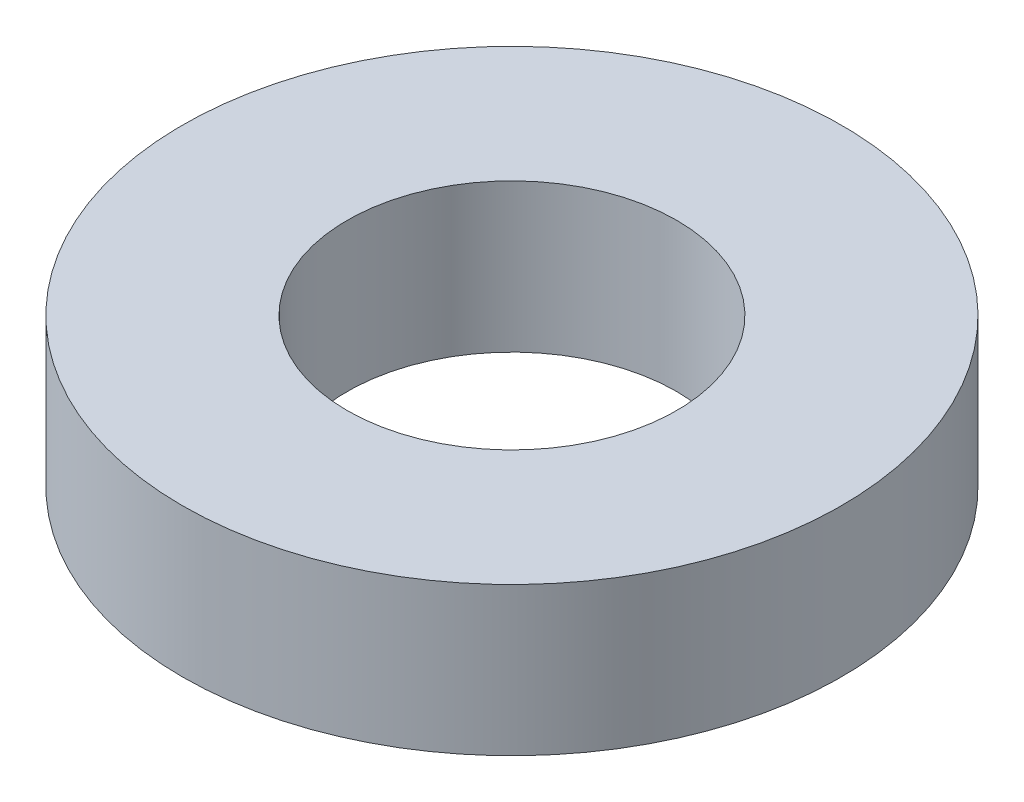
ISO-10303-21;
HEADER;
FILE_DESCRIPTION(('STEP AP214'),'2;1');
FILE_NAME('part.step','',(''),(''),'','','');
FILE_SCHEMA(('AUTOMOTIVE_DESIGN { 1 0 10303 214 1 1 1 1 }'));
ENDSEC;
DATA;
#1=APPLICATION_CONTEXT('core data for automotive mechanical design processes');
#2=APPLICATION_PROTOCOL_DEFINITION('international standard','automotive_design',2000,#1);
#3=PRODUCT_CONTEXT('',#1,'mechanical');
#4=PRODUCT('Part','Part','',(#3));
#5=PRODUCT_RELATED_PRODUCT_CATEGORY('part','',(#4));
#6=PRODUCT_DEFINITION_FORMATION('','',#4);
#7=PRODUCT_DEFINITION_CONTEXT('part definition',#1,'design');
#8=PRODUCT_DEFINITION('design','',#6,#7);
#9=PRODUCT_DEFINITION_SHAPE('','',#8);
#10=(LENGTH_UNIT() NAMED_UNIT(*) SI_UNIT(.MILLI.,.METRE.));
#11=(NAMED_UNIT(*) PLANE_ANGLE_UNIT() SI_UNIT($,.RADIAN.));
#12=(NAMED_UNIT(*) SI_UNIT($,.STERADIAN.) SOLID_ANGLE_UNIT());
#13=UNCERTAINTY_MEASURE_WITH_UNIT(LENGTH_MEASURE(1.E-05),#10,'distance_accuracy_value','');
#14=(GEOMETRIC_REPRESENTATION_CONTEXT(3) GLOBAL_UNCERTAINTY_ASSIGNED_CONTEXT((#13)) GLOBAL_UNIT_ASSIGNED_CONTEXT((#10,
#11,#12)) REPRESENTATION_CONTEXT('',''));
#15=CARTESIAN_POINT('',(0.,0.,0.));
#16=DIRECTION('',(0.,0.,1.));
#17=DIRECTION('',(1.,0.,0.));
#18=AXIS2_PLACEMENT_3D('',#15,#16,#17);
#19=CARTESIAN_POINT('',(0.,27.,0.));
#20=DIRECTION('',(0.,-1.,0.));
#21=DIRECTION('',(0.,0.,-1.));
#22=AXIS2_PLACEMENT_3D('',#19,#20,#21);
#23=CYLINDRICAL_SURFACE('',#22,60.);
#24=CARTESIAN_POINT('',(0.,27.,0.));
#25=DIRECTION('',(0.,1.,0.));
#26=DIRECTION('',(0.,0.,1.));
#27=AXIS2_PLACEMENT_3D('',#24,#25,#26);
#28=CIRCLE('',#27,60.);
#29=CARTESIAN_POINT('',(0.,27.,60.));
#30=VERTEX_POINT('',#29);
#31=EDGE_CURVE('E10',#30,#30,#28,.T.);
#32=ORIENTED_EDGE('',*,*,#31,.F.);
#33=EDGE_LOOP('',(#32));
#34=FACE_BOUND('',#33,.T.);
#35=CARTESIAN_POINT('',(0.,0.,0.));
#36=DIRECTION('',(0.,1.,0.));
#37=DIRECTION('',(0.,0.,1.));
#38=AXIS2_PLACEMENT_3D('',#35,#36,#37);
#39=CIRCLE('',#38,60.);
#40=CARTESIAN_POINT('',(0.,0.,60.));
#41=VERTEX_POINT('',#40);
#42=EDGE_CURVE('E37',#41,#41,#39,.T.);
#43=ORIENTED_EDGE('',*,*,#42,.T.);
#44=EDGE_LOOP('',(#43));
#45=FACE_BOUND('',#44,.T.);
#46=ADVANCED_FACE('F40',(#34,#45),#23,.T.);
#47=CARTESIAN_POINT('',(0.,27.,0.));
#48=DIRECTION('',(0.,1.,0.));
#49=DIRECTION('',(0.,0.,1.));
#50=AXIS2_PLACEMENT_3D('',#47,#48,#49);
#51=PLANE('',#50);
#52=CARTESIAN_POINT('',(0.,27.,0.));
#53=DIRECTION('',(0.,1.,0.));
#54=DIRECTION('',(0.,0.,1.));
#55=AXIS2_PLACEMENT_3D('',#52,#53,#54);
#56=CIRCLE('',#55,30.);
#57=CARTESIAN_POINT('',(0.,27.,30.));
#58=VERTEX_POINT('',#57);
#59=EDGE_CURVE('E50',#58,#58,#56,.T.);
#60=ORIENTED_EDGE('',*,*,#59,.F.);
#61=EDGE_LOOP('',(#60));
#62=FACE_BOUND('',#61,.T.);
#63=ORIENTED_EDGE('',*,*,#31,.T.);
#64=EDGE_LOOP('',(#63));
#65=FACE_BOUND('',#64,.T.);
#66=ADVANCED_FACE('F59',(#62,#65),#51,.T.);
#67=CARTESIAN_POINT('',(0.,0.,0.));
#68=DIRECTION('',(0.,1.,0.));
#69=DIRECTION('',(0.,0.,1.));
#70=AXIS2_PLACEMENT_3D('',#67,#68,#69);
#71=PLANE('',#70);
#72=CARTESIAN_POINT('',(0.,0.,0.));
#73=DIRECTION('',(0.,1.,0.));
#74=DIRECTION('',(0.,0.,1.));
#75=AXIS2_PLACEMENT_3D('',#72,#73,#74);
#76=CIRCLE('',#75,30.);
#77=CARTESIAN_POINT('',(0.,0.,30.));
#78=VERTEX_POINT('',#77);
#79=EDGE_CURVE('E47',#78,#78,#76,.T.);
#80=ORIENTED_EDGE('',*,*,#79,.T.);
#81=EDGE_LOOP('',(#80));
#82=FACE_BOUND('',#81,.T.);
#83=ORIENTED_EDGE('',*,*,#42,.F.);
#84=EDGE_LOOP('',(#83));
#85=FACE_BOUND('',#84,.T.);
#86=ADVANCED_FACE('F58',(#82,#85),#71,.F.);
#87=CARTESIAN_POINT('',(0.,27.,0.));
#88=DIRECTION('',(0.,-1.,0.));
#89=DIRECTION('',(0.,0.,-1.));
#90=AXIS2_PLACEMENT_3D('',#87,#88,#89);
#91=CYLINDRICAL_SURFACE('',#90,30.);
#92=ORIENTED_EDGE('',*,*,#59,.T.);
#93=EDGE_LOOP('',(#92));
#94=FACE_BOUND('',#93,.T.);
#95=ORIENTED_EDGE('',*,*,#79,.F.);
#96=EDGE_LOOP('',(#95));
#97=FACE_BOUND('',#96,.T.);
#98=ADVANCED_FACE('F54',(#94,#97),#91,.F.);
#99=CLOSED_SHELL('',(#46,#66,#86,#98));
#100=MANIFOLD_SOLID_BREP('B2',#99);
#101=ADVANCED_BREP_SHAPE_REPRESENTATION('',(#18,#100),#14);
#102=SHAPE_DEFINITION_REPRESENTATION(#9,#101);
ENDSEC;
END-ISO-10303-21;
